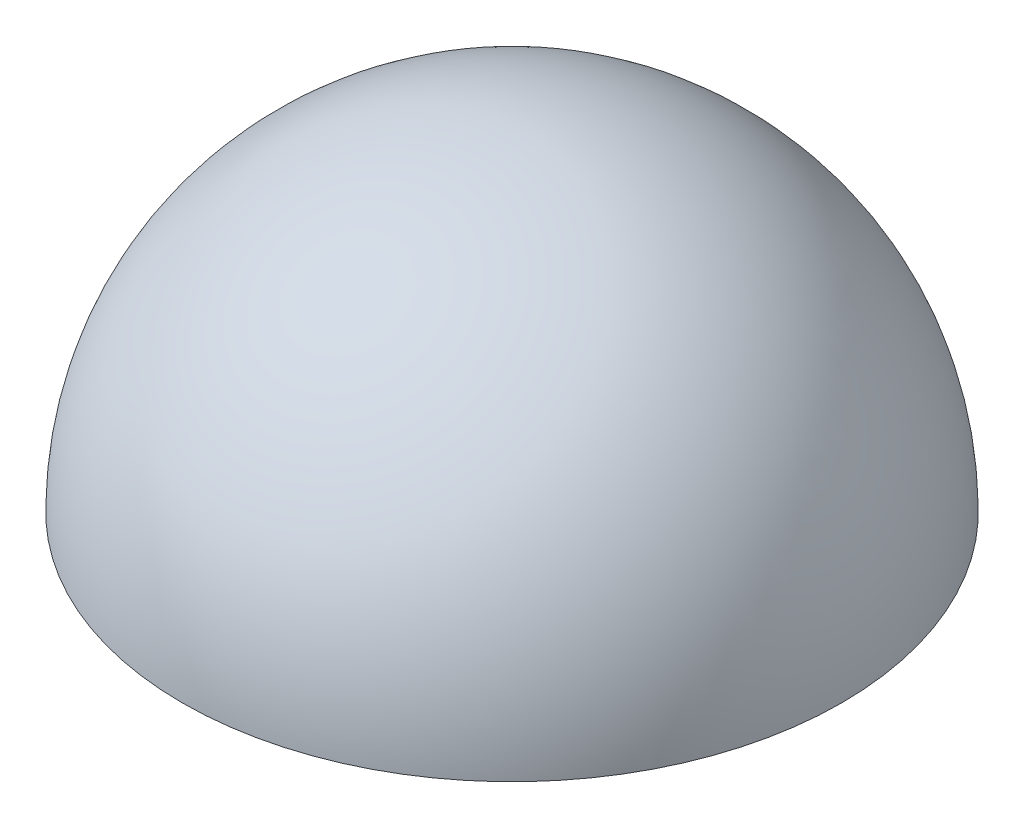
ISO-10303-21;
HEADER;
FILE_DESCRIPTION(('STEP AP214'),'2;1');
FILE_NAME('part.step','',(''),(''),'','','');
FILE_SCHEMA(('AUTOMOTIVE_DESIGN { 1 0 10303 214 1 1 1 1 }'));
ENDSEC;
DATA;
#1=APPLICATION_CONTEXT('core data for automotive mechanical design processes');
#2=APPLICATION_PROTOCOL_DEFINITION('international standard','automotive_design',2000,#1);
#3=PRODUCT_CONTEXT('',#1,'mechanical');
#4=PRODUCT('Part','Part','',(#3));
#5=PRODUCT_RELATED_PRODUCT_CATEGORY('part','',(#4));
#6=PRODUCT_DEFINITION_FORMATION('','',#4);
#7=PRODUCT_DEFINITION_CONTEXT('part definition',#1,'design');
#8=PRODUCT_DEFINITION('design','',#6,#7);
#9=PRODUCT_DEFINITION_SHAPE('','',#8);
#10=(LENGTH_UNIT() NAMED_UNIT(*) SI_UNIT(.MILLI.,.METRE.));
#11=(NAMED_UNIT(*) PLANE_ANGLE_UNIT() SI_UNIT($,.RADIAN.));
#12=(NAMED_UNIT(*) SI_UNIT($,.STERADIAN.) SOLID_ANGLE_UNIT());
#13=UNCERTAINTY_MEASURE_WITH_UNIT(LENGTH_MEASURE(1.E-05),#10,'distance_accuracy_value','');
#14=(GEOMETRIC_REPRESENTATION_CONTEXT(3) GLOBAL_UNCERTAINTY_ASSIGNED_CONTEXT((#13)) GLOBAL_UNIT_ASSIGNED_CONTEXT((#10,
#11,#12)) REPRESENTATION_CONTEXT('',''));
#15=CARTESIAN_POINT('',(0.,0.,0.));
#16=DIRECTION('',(0.,0.,1.));
#17=DIRECTION('',(1.,0.,0.));
#18=AXIS2_PLACEMENT_3D('',#15,#16,#17);
#19=CARTESIAN_POINT('',(0.,0.,0.));
#20=DIRECTION('',(0.,1.,0.));
#21=DIRECTION('',(-1.,0.,0.));
#22=AXIS2_PLACEMENT_3D('',#19,#20,#21);
#23=PLANE('',#22);
#24=CARTESIAN_POINT('',(0.,0.,0.));
#25=DIRECTION('',(0.,1.,0.));
#26=DIRECTION('',(-1.,0.,0.));
#27=AXIS2_PLACEMENT_3D('',#24,#25,#26);
#28=CIRCLE('',#27,3.1);
#29=CARTESIAN_POINT('',(-3.1,0.,0.));
#30=VERTEX_POINT('',#29);
#31=EDGE_CURVE('E11',#30,#30,#28,.T.);
#32=ORIENTED_EDGE('',*,*,#31,.F.);
#33=EDGE_LOOP('',(#32));
#34=FACE_BOUND('',#33,.T.);
#35=ADVANCED_FACE('F44',(#34),#23,.F.);
#36=CARTESIAN_POINT('',(0.,0.,0.));
#37=DIRECTION('',(0.,1.,0.));
#38=DIRECTION('',(1.,0.,0.));
#39=AXIS2_PLACEMENT_3D('',#36,#37,#38);
#40=SPHERICAL_SURFACE('',#39,3.1);
#41=ORIENTED_EDGE('',*,*,#31,.T.);
#42=EDGE_LOOP('',(#41));
#43=FACE_BOUND('',#42,.T.);
#44=ADVANCED_FACE('F55',(#43),#40,.T.);
#45=CLOSED_SHELL('',(#35,#44));
#46=MANIFOLD_SOLID_BREP('B2',#45);
#47=CARTESIAN_POINT('',(0.,0.,0.));
#48=DIRECTION('',(0.,1.,0.));
#49=DIRECTION('',(-1.,0.,0.));
#50=AXIS2_PLACEMENT_3D('',#47,#48,#49);
#51=SPHERICAL_SURFACE('',#50,3.2);
#52=CARTESIAN_POINT('',(0.,0.,0.));
#53=DIRECTION('',(0.,1.,0.));
#54=DIRECTION('',(-1.,0.,0.));
#55=AXIS2_PLACEMENT_3D('',#52,#53,#54);
#56=CIRCLE('',#55,3.2);
#57=CARTESIAN_POINT('',(-3.2,0.,0.));
#58=VERTEX_POINT('',#57);
#59=EDGE_CURVE('E42',#58,#58,#56,.T.);
#60=ORIENTED_EDGE('',*,*,#59,.F.);
#61=EDGE_LOOP('',(#60));
#62=FACE_BOUND('',#61,.T.);
#63=ADVANCED_FACE('F72',(#62),#51,.F.);
#64=CARTESIAN_POINT('',(3.8,0.,0.));
#65=DIRECTION('',(0.,1.,0.));
#66=DIRECTION('',(-1.,0.,0.));
#67=AXIS2_PLACEMENT_3D('',#64,#65,#66);
#68=PLANE('',#67);
#69=CARTESIAN_POINT('',(0.,0.,0.));
#70=DIRECTION('',(0.,1.,0.));
#71=DIRECTION('',(-1.,0.,0.));
#72=AXIS2_PLACEMENT_3D('',#69,#70,#71);
#73=CIRCLE('',#72,3.8);
#74=CARTESIAN_POINT('',(-3.8,0.,0.));
#75=VERTEX_POINT('',#74);
#76=EDGE_CURVE('E80',#75,#75,#73,.T.);
#77=ORIENTED_EDGE('',*,*,#76,.F.);
#78=EDGE_LOOP('',(#77));
#79=FACE_BOUND('',#78,.T.);
#80=ORIENTED_EDGE('',*,*,#59,.T.);
#81=EDGE_LOOP('',(#80));
#82=FACE_BOUND('',#81,.T.);
#83=ADVANCED_FACE('F83',(#79,#82),#68,.F.);
#84=CARTESIAN_POINT('',(0.,0.,0.));
#85=DIRECTION('',(0.,1.,0.));
#86=DIRECTION('',(1.,0.,0.));
#87=AXIS2_PLACEMENT_3D('',#84,#85,#86);
#88=SPHERICAL_SURFACE('',#87,3.8);
#89=ORIENTED_EDGE('',*,*,#76,.T.);
#90=EDGE_LOOP('',(#89));
#91=FACE_BOUND('',#90,.T.);
#92=ADVANCED_FACE('F85',(#91),#88,.T.);
#93=CLOSED_SHELL('',(#63,#83,#92));
#94=MANIFOLD_SOLID_BREP('B6',#93);
#95=ADVANCED_BREP_SHAPE_REPRESENTATION('',(#18,#46,#94),#14);
#96=SHAPE_DEFINITION_REPRESENTATION(#9,#95);
ENDSEC;
END-ISO-10303-21;
